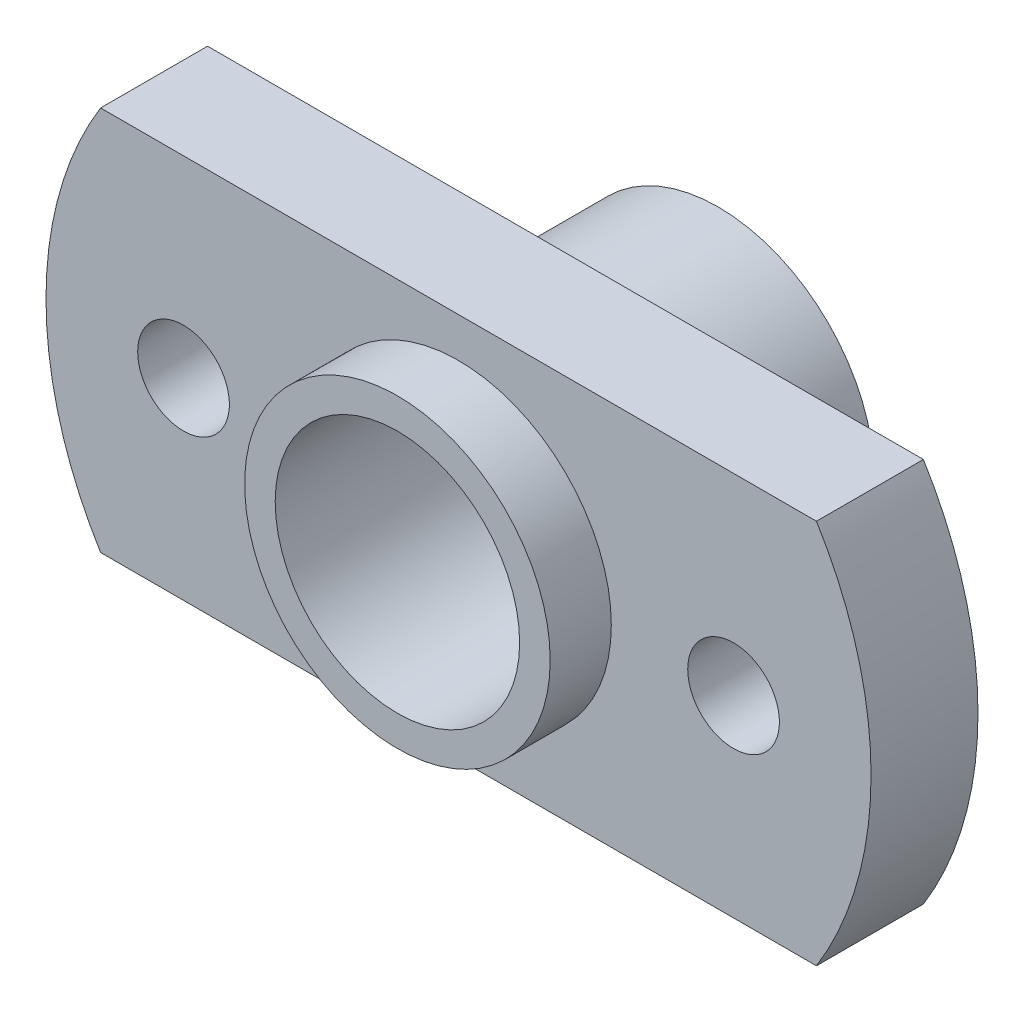
ISO-10303-21;
HEADER;
FILE_DESCRIPTION(('STEP AP214'),'2;1');
FILE_NAME('part.step','',(''),(''),'','','');
FILE_SCHEMA(('AUTOMOTIVE_DESIGN { 1 0 10303 214 1 1 1 1 }'));
ENDSEC;
DATA;
#1=APPLICATION_CONTEXT('core data for automotive mechanical design processes');
#2=APPLICATION_PROTOCOL_DEFINITION('international standard','automotive_design',2000,#1);
#3=PRODUCT_CONTEXT('',#1,'mechanical');
#4=PRODUCT('Part','Part','',(#3));
#5=PRODUCT_RELATED_PRODUCT_CATEGORY('part','',(#4));
#6=PRODUCT_DEFINITION_FORMATION('','',#4);
#7=PRODUCT_DEFINITION_CONTEXT('part definition',#1,'design');
#8=PRODUCT_DEFINITION('design','',#6,#7);
#9=PRODUCT_DEFINITION_SHAPE('','',#8);
#10=(LENGTH_UNIT() NAMED_UNIT(*) SI_UNIT(.MILLI.,.METRE.));
#11=(NAMED_UNIT(*) PLANE_ANGLE_UNIT() SI_UNIT($,.RADIAN.));
#12=(NAMED_UNIT(*) SI_UNIT($,.STERADIAN.) SOLID_ANGLE_UNIT());
#13=UNCERTAINTY_MEASURE_WITH_UNIT(LENGTH_MEASURE(1.E-05),#10,'distance_accuracy_value','');
#14=(GEOMETRIC_REPRESENTATION_CONTEXT(3) GLOBAL_UNCERTAINTY_ASSIGNED_CONTEXT((#13)) GLOBAL_UNIT_ASSIGNED_CONTEXT((#10,
#11,#12)) REPRESENTATION_CONTEXT('',''));
#15=CARTESIAN_POINT('',(0.,0.,0.));
#16=DIRECTION('',(0.,0.,1.));
#17=DIRECTION('',(1.,0.,0.));
#18=AXIS2_PLACEMENT_3D('',#15,#16,#17);
#19=CARTESIAN_POINT('',(-166.1,-80.50005788601,172.0264319846));
#20=DIRECTION('',(0.,0.,1.));
#21=DIRECTION('',(1.,0.,0.));
#22=AXIS2_PLACEMENT_3D('',#19,#20,#21);
#23=PLANE('',#22);
#24=CARTESIAN_POINT('',(-166.1,-80.50005788601,172.0264319846));
#25=DIRECTION('',(0.,0.,-1.));
#26=DIRECTION('',(-1.,0.,0.));
#27=AXIS2_PLACEMENT_3D('',#24,#25,#26);
#28=CIRCLE('',#27,4.);
#29=CARTESIAN_POINT('',(-170.1,-80.50005788601,172.0264319846));
#30=VERTEX_POINT('',#29);
#31=EDGE_CURVE('E112',#30,#30,#28,.F.);
#32=ORIENTED_EDGE('',*,*,#31,.T.);
#33=EDGE_LOOP('',(#32));
#34=FACE_BOUND('',#33,.T.);
#35=CARTESIAN_POINT('',(-166.1,-80.50005788601,172.0264319846));
#36=DIRECTION('',(0.,0.,-1.));
#37=DIRECTION('',(-1.,0.,0.));
#38=AXIS2_PLACEMENT_3D('',#35,#36,#37);
#39=CIRCLE('',#38,5.09999999999999);
#40=CARTESIAN_POINT('',(-171.2,-80.50005788601,172.0264319846));
#41=VERTEX_POINT('',#40);
#42=EDGE_CURVE('E20',#41,#41,#39,.F.);
#43=ORIENTED_EDGE('',*,*,#42,.F.);
#44=EDGE_LOOP('',(#43));
#45=FACE_BOUND('',#44,.T.);
#46=ADVANCED_FACE('F17',(#34,#45),#23,.F.);
#47=CARTESIAN_POINT('',(-166.1,-80.50005788601,182.5264319846));
#48=DIRECTION('',(0.,0.,-1.));
#49=DIRECTION('',(-1.,0.,0.));
#50=AXIS2_PLACEMENT_3D('',#47,#48,#49);
#51=CYLINDRICAL_SURFACE('',#50,5.09999999999999);
#52=ORIENTED_EDGE('',*,*,#42,.T.);
#53=EDGE_LOOP('',(#52));
#54=FACE_BOUND('',#53,.T.);
#55=CARTESIAN_POINT('',(-166.1,-80.50005788601,177.0264319846));
#56=DIRECTION('',(0.,0.,-1.));
#57=DIRECTION('',(-1.,0.,0.));
#58=AXIS2_PLACEMENT_3D('',#55,#56,#57);
#59=CIRCLE('',#58,5.09999999999999);
#60=CARTESIAN_POINT('',(-171.2,-80.50005788601,177.0264319846));
#61=VERTEX_POINT('',#60);
#62=EDGE_CURVE('E110',#61,#61,#59,.T.);
#63=ORIENTED_EDGE('',*,*,#62,.T.);
#64=EDGE_LOOP('',(#63));
#65=FACE_BOUND('',#64,.T.);
#66=ADVANCED_FACE('F119',(#54,#65),#51,.T.);
#67=CARTESIAN_POINT('',(-166.1,-80.50005788601,182.5264319846));
#68=DIRECTION('',(0.,0.,-1.));
#69=DIRECTION('',(-1.,0.,0.));
#70=AXIS2_PLACEMENT_3D('',#67,#68,#69);
#71=CYLINDRICAL_SURFACE('',#70,4.);
#72=CARTESIAN_POINT('',(-166.1,-80.50005788601,182.5264319846));
#73=DIRECTION('',(0.,0.,-1.));
#74=DIRECTION('',(-1.,0.,0.));
#75=AXIS2_PLACEMENT_3D('',#72,#73,#74);
#76=CIRCLE('',#75,4.);
#77=CARTESIAN_POINT('',(-170.1,-80.50005788601,182.5264319846));
#78=VERTEX_POINT('',#77);
#79=EDGE_CURVE('E107',#78,#78,#76,.T.);
#80=ORIENTED_EDGE('',*,*,#79,.F.);
#81=EDGE_LOOP('',(#80));
#82=FACE_BOUND('',#81,.T.);
#83=ORIENTED_EDGE('',*,*,#31,.F.);
#84=EDGE_LOOP('',(#83));
#85=FACE_BOUND('',#84,.T.);
#86=ADVANCED_FACE('F126',(#82,#85),#71,.F.);
#87=CARTESIAN_POINT('',(-166.1,-80.50005788601,177.0264319846));
#88=DIRECTION('',(0.,0.,1.));
#89=DIRECTION('',(1.,0.,0.));
#90=AXIS2_PLACEMENT_3D('',#87,#88,#89);
#91=PLANE('',#90);
#92=ORIENTED_EDGE('',*,*,#62,.F.);
#93=EDGE_LOOP('',(#92));
#94=FACE_BOUND('',#93,.T.);
#95=DIRECTION('',(1.,0.,0.));
#96=VECTOR('',#95,1.);
#97=CARTESIAN_POINT('',(-155.8528172695,-74.20005788601,177.0264319846));
#98=LINE('',#97,#96);
#99=CARTESIAN_POINT('',(-177.813226718326,-74.20005788601,177.0264319846));
#100=VERTEX_POINT('',#99);
#101=CARTESIAN_POINT('',(-154.386773281667,-74.20005788601,177.0264319846));
#102=VERTEX_POINT('',#101);
#103=EDGE_CURVE('E61',#100,#102,#98,.T.);
#104=ORIENTED_EDGE('',*,*,#103,.T.);
#105=CARTESIAN_POINT('',(-164.6,-80.50005788601,177.0264319846));
#106=DIRECTION('',(0.,0.,1.));
#107=DIRECTION('',(1.,0.,0.));
#108=AXIS2_PLACEMENT_3D('',#105,#106,#107);
#109=CIRCLE('',#108,12.);
#110=CARTESIAN_POINT('',(-154.386773281659,-86.8000578859906,177.0264319846));
#111=VERTEX_POINT('',#110);
#112=EDGE_CURVE('E81',#111,#102,#109,.T.);
#113=ORIENTED_EDGE('',*,*,#112,.F.);
#114=DIRECTION('',(1.,0.,0.));
#115=VECTOR('',#114,1.);
#116=CARTESIAN_POINT('',(-177.6681148043,-86.80005788601,177.0264319846));
#117=LINE('',#116,#115);
#118=CARTESIAN_POINT('',(-177.813226718329,-86.80005788601,177.0264319846));
#119=VERTEX_POINT('',#118);
#120=EDGE_CURVE('E64',#111,#119,#117,.F.);
#121=ORIENTED_EDGE('',*,*,#120,.T.);
#122=CARTESIAN_POINT('',(-167.6,-80.50005788601,177.0264319846));
#123=DIRECTION('',(0.,0.,1.));
#124=DIRECTION('',(1.,0.,0.));
#125=AXIS2_PLACEMENT_3D('',#122,#123,#124);
#126=CIRCLE('',#125,12.);
#127=EDGE_CURVE('E56',#100,#119,#126,.T.);
#128=ORIENTED_EDGE('',*,*,#127,.F.);
#129=EDGE_LOOP('',(#104,#113,#121,#128));
#130=FACE_BOUND('',#129,.T.);
#131=CARTESIAN_POINT('',(-175.1,-80.50005788601,177.0264319846));
#132=DIRECTION('',(0.,0.,-1.));
#133=DIRECTION('',(-1.,0.,0.));
#134=AXIS2_PLACEMENT_3D('',#131,#132,#133);
#135=CIRCLE('',#134,1.5);
#136=CARTESIAN_POINT('',(-176.6,-80.50005788601,177.0264319846));
#137=VERTEX_POINT('',#136);
#138=EDGE_CURVE('E67',#137,#137,#135,.F.);
#139=ORIENTED_EDGE('',*,*,#138,.T.);
#140=EDGE_LOOP('',(#139));
#141=FACE_BOUND('',#140,.T.);
#142=CARTESIAN_POINT('',(-157.1,-80.50005788601,177.0264319846));
#143=DIRECTION('',(0.,0.,-1.));
#144=DIRECTION('',(-1.,0.,0.));
#145=AXIS2_PLACEMENT_3D('',#142,#143,#144);
#146=CIRCLE('',#145,1.5);
#147=CARTESIAN_POINT('',(-158.6,-80.50005788601,177.0264319846));
#148=VERTEX_POINT('',#147);
#149=EDGE_CURVE('E104',#148,#148,#146,.F.);
#150=ORIENTED_EDGE('',*,*,#149,.T.);
#151=EDGE_LOOP('',(#150));
#152=FACE_BOUND('',#151,.T.);
#153=ADVANCED_FACE('F58',(#94,#130,#141,#152),#91,.F.);
#154=CARTESIAN_POINT('',(533.2347338397,-344.6602275476,182.5264319846));
#155=DIRECTION('',(0.,0.,1.));
#156=DIRECTION('',(1.,0.,0.));
#157=AXIS2_PLACEMENT_3D('',#154,#155,#156);
#158=PLANE('',#157);
#159=ORIENTED_EDGE('',*,*,#79,.T.);
#160=EDGE_LOOP('',(#159));
#161=FACE_BOUND('',#160,.T.);
#162=CARTESIAN_POINT('',(-166.1,-80.50005788601,182.5264319846));
#163=DIRECTION('',(0.,0.,1.));
#164=DIRECTION('',(1.,0.,0.));
#165=AXIS2_PLACEMENT_3D('',#162,#163,#164);
#166=CIRCLE('',#165,5.);
#167=CARTESIAN_POINT('',(-161.1,-80.50005788601,182.5264319846));
#168=VERTEX_POINT('',#167);
#169=EDGE_CURVE('E76',#168,#168,#166,.F.);
#170=ORIENTED_EDGE('',*,*,#169,.F.);
#171=EDGE_LOOP('',(#170));
#172=FACE_BOUND('',#171,.T.);
#173=ADVANCED_FACE('F157',(#161,#172),#158,.T.);
#174=CARTESIAN_POINT('',(-157.1,-80.50005788601,180.5264319846));
#175=DIRECTION('',(0.,0.,-1.));
#176=DIRECTION('',(-1.,0.,0.));
#177=AXIS2_PLACEMENT_3D('',#174,#175,#176);
#178=CYLINDRICAL_SURFACE('',#177,1.5);
#179=ORIENTED_EDGE('',*,*,#149,.F.);
#180=EDGE_LOOP('',(#179));
#181=FACE_BOUND('',#180,.T.);
#182=CARTESIAN_POINT('',(-157.1,-80.50005788601,180.5264319846));
#183=DIRECTION('',(0.,0.,-1.));
#184=DIRECTION('',(-1.,0.,0.));
#185=AXIS2_PLACEMENT_3D('',#182,#183,#184);
#186=CIRCLE('',#185,1.5);
#187=CARTESIAN_POINT('',(-158.6,-80.50005788601,180.5264319846));
#188=VERTEX_POINT('',#187);
#189=EDGE_CURVE('E97',#188,#188,#186,.T.);
#190=ORIENTED_EDGE('',*,*,#189,.F.);
#191=EDGE_LOOP('',(#190));
#192=FACE_BOUND('',#191,.T.);
#193=ADVANCED_FACE('F153',(#181,#192),#178,.F.);
#194=CARTESIAN_POINT('',(-175.1,-80.50005788601,180.5264319846));
#195=DIRECTION('',(0.,0.,-1.));
#196=DIRECTION('',(-1.,0.,0.));
#197=AXIS2_PLACEMENT_3D('',#194,#195,#196);
#198=CYLINDRICAL_SURFACE('',#197,1.5);
#199=ORIENTED_EDGE('',*,*,#138,.F.);
#200=EDGE_LOOP('',(#199));
#201=FACE_BOUND('',#200,.T.);
#202=CARTESIAN_POINT('',(-175.1,-80.50005788601,180.5264319846));
#203=DIRECTION('',(0.,0.,-1.));
#204=DIRECTION('',(-1.,0.,0.));
#205=AXIS2_PLACEMENT_3D('',#202,#203,#204);
#206=CIRCLE('',#205,1.5);
#207=CARTESIAN_POINT('',(-176.6,-80.50005788601,180.5264319846));
#208=VERTEX_POINT('',#207);
#209=EDGE_CURVE('E94',#208,#208,#206,.T.);
#210=ORIENTED_EDGE('',*,*,#209,.F.);
#211=EDGE_LOOP('',(#210));
#212=FACE_BOUND('',#211,.T.);
#213=ADVANCED_FACE('F150',(#201,#212),#198,.F.);
#214=CARTESIAN_POINT('',(-167.6,-80.50005788601,180.5264319846));
#215=DIRECTION('',(0.,0.,1.));
#216=DIRECTION('',(1.,0.,0.));
#217=AXIS2_PLACEMENT_3D('',#214,#215,#216);
#218=CYLINDRICAL_SURFACE('',#217,12.);
#219=DIRECTION('',(0.,0.,-1.));
#220=VECTOR('',#219,1.);
#221=CARTESIAN_POINT('',(-177.813226718323,-74.20005788601,177.0264319846));
#222=LINE('',#221,#220);
#223=CARTESIAN_POINT('',(-177.813226718328,-74.200057886013,180.5264319846));
#224=VERTEX_POINT('',#223);
#225=EDGE_CURVE('E70',#224,#100,#222,.T.);
#226=ORIENTED_EDGE('',*,*,#225,.T.);
#227=ORIENTED_EDGE('',*,*,#127,.T.);
#228=DIRECTION('',(0.,0.,1.));
#229=VECTOR('',#228,1.);
#230=CARTESIAN_POINT('',(-177.813226718329,-86.80005788601,177.0264319846));
#231=LINE('',#230,#229);
#232=CARTESIAN_POINT('',(-177.813226718329,-86.80005788601,180.5264319846));
#233=VERTEX_POINT('',#232);
#234=EDGE_CURVE('E88',#119,#233,#231,.T.);
#235=ORIENTED_EDGE('',*,*,#234,.T.);
#236=CARTESIAN_POINT('',(-167.6,-80.50005788601,180.5264319846));
#237=DIRECTION('',(0.,0.,1.));
#238=DIRECTION('',(1.,0.,0.));
#239=AXIS2_PLACEMENT_3D('',#236,#237,#238);
#240=CIRCLE('',#239,12.);
#241=EDGE_CURVE('E73',#224,#233,#240,.T.);
#242=ORIENTED_EDGE('',*,*,#241,.F.);
#243=EDGE_LOOP('',(#226,#227,#235,#242));
#244=FACE_BOUND('',#243,.T.);
#245=ADVANCED_FACE('F71',(#244),#218,.T.);
#246=CARTESIAN_POINT('',(-177.6681148043,-86.80005788601,177.0264319846));
#247=DIRECTION('',(0.,1.,0.));
#248=DIRECTION('',(0.,0.,1.));
#249=AXIS2_PLACEMENT_3D('',#246,#247,#248);
#250=PLANE('',#249);
#251=ORIENTED_EDGE('',*,*,#120,.F.);
#252=DIRECTION('',(0.,0.,1.));
#253=VECTOR('',#252,1.);
#254=CARTESIAN_POINT('',(-154.386773281647,-86.8000578859713,180.5264319846));
#255=LINE('',#254,#253);
#256=CARTESIAN_POINT('',(-154.386773281659,-86.8000578859906,180.5264319846));
#257=VERTEX_POINT('',#256);
#258=EDGE_CURVE('E84',#257,#111,#255,.F.);
#259=ORIENTED_EDGE('',*,*,#258,.F.);
#260=DIRECTION('',(1.,0.,0.));
#261=VECTOR('',#260,1.);
#262=CARTESIAN_POINT('',(-166.1,-86.80005788601,180.5264319846));
#263=LINE('',#262,#261);
#264=EDGE_CURVE('E92',#233,#257,#263,.T.);
#265=ORIENTED_EDGE('',*,*,#264,.F.);
#266=ORIENTED_EDGE('',*,*,#234,.F.);
#267=EDGE_LOOP('',(#251,#259,#265,#266));
#268=FACE_BOUND('',#267,.T.);
#269=ADVANCED_FACE('F143',(#268),#250,.F.);
#270=CARTESIAN_POINT('',(-164.6,-80.50005788601,180.5264319846));
#271=DIRECTION('',(0.,0.,1.));
#272=DIRECTION('',(1.,0.,0.));
#273=AXIS2_PLACEMENT_3D('',#270,#271,#272);
#274=CYLINDRICAL_SURFACE('',#273,12.);
#275=DIRECTION('',(0.,0.,-1.));
#276=VECTOR('',#275,1.);
#277=CARTESIAN_POINT('',(-154.386773281663,-74.20005788601,177.0264319846));
#278=LINE('',#277,#276);
#279=CARTESIAN_POINT('',(-154.386773281665,-74.200057886013,180.5264319846));
#280=VERTEX_POINT('',#279);
#281=EDGE_CURVE('E77',#102,#280,#278,.F.);
#282=ORIENTED_EDGE('',*,*,#281,.T.);
#283=CARTESIAN_POINT('',(-164.6,-80.50005788601,180.5264319846));
#284=DIRECTION('',(0.,0.,1.));
#285=DIRECTION('',(1.,0.,0.));
#286=AXIS2_PLACEMENT_3D('',#283,#284,#285);
#287=CIRCLE('',#286,12.);
#288=EDGE_CURVE('E35',#257,#280,#287,.T.);
#289=ORIENTED_EDGE('',*,*,#288,.F.);
#290=ORIENTED_EDGE('',*,*,#258,.T.);
#291=ORIENTED_EDGE('',*,*,#112,.T.);
#292=EDGE_LOOP('',(#282,#289,#290,#291));
#293=FACE_BOUND('',#292,.T.);
#294=ADVANCED_FACE('F140',(#293),#274,.T.);
#295=CARTESIAN_POINT('',(-155.8528172695,-74.20005788601,177.0264319846));
#296=DIRECTION('',(0.,-1.,0.));
#297=DIRECTION('',(0.,0.,-1.));
#298=AXIS2_PLACEMENT_3D('',#295,#296,#297);
#299=PLANE('',#298);
#300=DIRECTION('',(1.,0.,0.));
#301=VECTOR('',#300,1.);
#302=CARTESIAN_POINT('',(-166.1,-74.200057886016,180.5264319846));
#303=LINE('',#302,#301);
#304=EDGE_CURVE('E26',#280,#224,#303,.F.);
#305=ORIENTED_EDGE('',*,*,#304,.F.);
#306=ORIENTED_EDGE('',*,*,#281,.F.);
#307=ORIENTED_EDGE('',*,*,#103,.F.);
#308=ORIENTED_EDGE('',*,*,#225,.F.);
#309=EDGE_LOOP('',(#305,#306,#307,#308));
#310=FACE_BOUND('',#309,.T.);
#311=ADVANCED_FACE('F80',(#310),#299,.F.);
#312=CARTESIAN_POINT('',(-166.1,-80.50005788601,180.5264319846));
#313=DIRECTION('',(0.,0.,1.));
#314=DIRECTION('',(1.,0.,0.));
#315=AXIS2_PLACEMENT_3D('',#312,#313,#314);
#316=CYLINDRICAL_SURFACE('',#315,5.);
#317=ORIENTED_EDGE('',*,*,#169,.T.);
#318=EDGE_LOOP('',(#317));
#319=FACE_BOUND('',#318,.T.);
#320=CARTESIAN_POINT('',(-166.1,-80.50005788601,180.5264319846));
#321=DIRECTION('',(0.,0.,1.));
#322=DIRECTION('',(1.,0.,0.));
#323=AXIS2_PLACEMENT_3D('',#320,#321,#322);
#324=CIRCLE('',#323,5.);
#325=CARTESIAN_POINT('',(-161.1,-80.50005788601,180.5264319846));
#326=VERTEX_POINT('',#325);
#327=EDGE_CURVE('E10',#326,#326,#324,.F.);
#328=ORIENTED_EDGE('',*,*,#327,.F.);
#329=EDGE_LOOP('',(#328));
#330=FACE_BOUND('',#329,.T.);
#331=ADVANCED_FACE('F129',(#319,#330),#316,.T.);
#332=CARTESIAN_POINT('',(-166.1,-80.50005788601,180.5264319846));
#333=DIRECTION('',(0.,0.,1.));
#334=DIRECTION('',(1.,0.,0.));
#335=AXIS2_PLACEMENT_3D('',#332,#333,#334);
#336=PLANE('',#335);
#337=ORIENTED_EDGE('',*,*,#327,.T.);
#338=EDGE_LOOP('',(#337));
#339=FACE_BOUND('',#338,.T.);
#340=ORIENTED_EDGE('',*,*,#288,.T.);
#341=ORIENTED_EDGE('',*,*,#304,.T.);
#342=ORIENTED_EDGE('',*,*,#241,.T.);
#343=ORIENTED_EDGE('',*,*,#264,.T.);
#344=EDGE_LOOP('',(#340,#341,#342,#343));
#345=FACE_BOUND('',#344,.T.);
#346=ORIENTED_EDGE('',*,*,#209,.T.);
#347=EDGE_LOOP('',(#346));
#348=FACE_BOUND('',#347,.T.);
#349=ORIENTED_EDGE('',*,*,#189,.T.);
#350=EDGE_LOOP('',(#349));
#351=FACE_BOUND('',#350,.T.);
#352=ADVANCED_FACE('F127',(#339,#345,#348,#351),#336,.T.);
#353=CLOSED_SHELL('',(#46,#66,#86,#153,#173,#193,#213,#245,#269,#294,#311,#331,#352));
#354=MANIFOLD_SOLID_BREP('B1',#353);
#355=ADVANCED_BREP_SHAPE_REPRESENTATION('',(#18,#354),#14);
#356=SHAPE_DEFINITION_REPRESENTATION(#9,#355);
ENDSEC;
END-ISO-10303-21;
